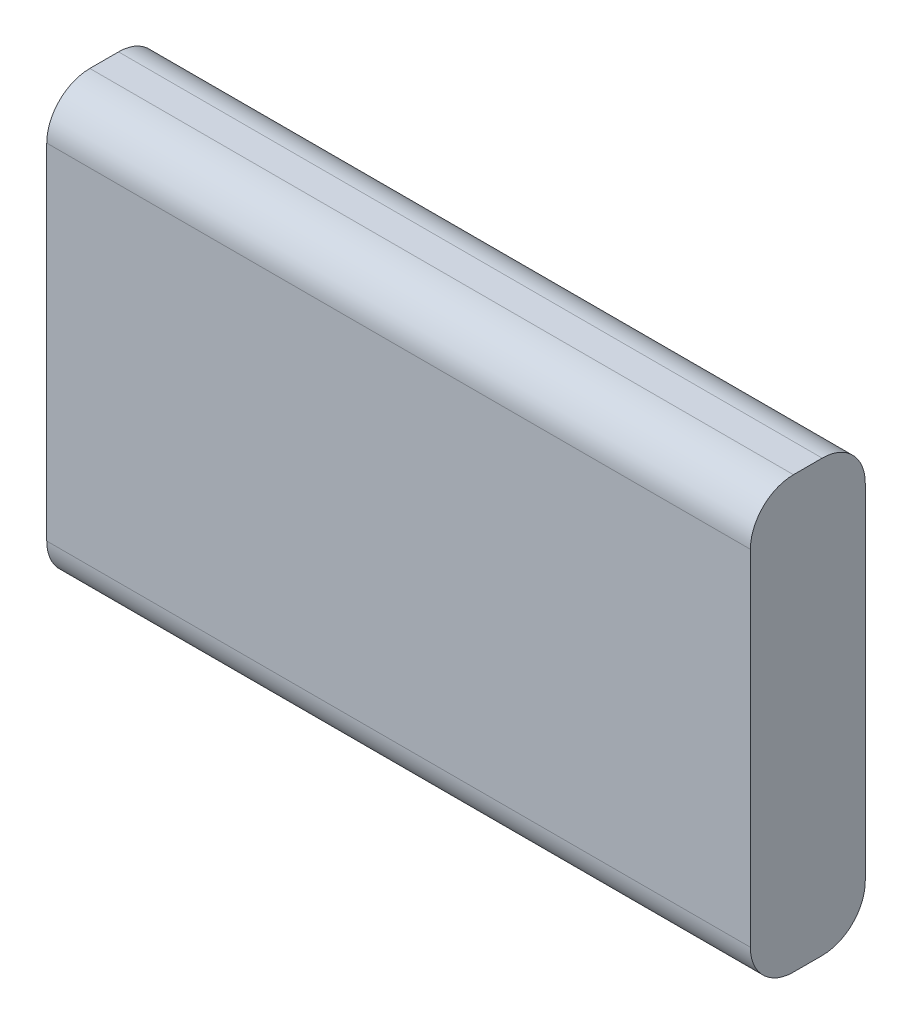
ISO-10303-21;
HEADER;
FILE_DESCRIPTION(('STEP AP214'),'2;1');
FILE_NAME('part.step','',(''),(''),'','','');
FILE_SCHEMA(('AUTOMOTIVE_DESIGN { 1 0 10303 214 1 1 1 1 }'));
ENDSEC;
DATA;
#1=APPLICATION_CONTEXT('core data for automotive mechanical design processes');
#2=APPLICATION_PROTOCOL_DEFINITION('international standard','automotive_design',2000,#1);
#3=PRODUCT_CONTEXT('',#1,'mechanical');
#4=PRODUCT('Part','Part','',(#3));
#5=PRODUCT_RELATED_PRODUCT_CATEGORY('part','',(#4));
#6=PRODUCT_DEFINITION_FORMATION('','',#4);
#7=PRODUCT_DEFINITION_CONTEXT('part definition',#1,'design');
#8=PRODUCT_DEFINITION('design','',#6,#7);
#9=PRODUCT_DEFINITION_SHAPE('','',#8);
#10=(LENGTH_UNIT() NAMED_UNIT(*) SI_UNIT(.MILLI.,.METRE.));
#11=(NAMED_UNIT(*) PLANE_ANGLE_UNIT() SI_UNIT($,.RADIAN.));
#12=(NAMED_UNIT(*) SI_UNIT($,.STERADIAN.) SOLID_ANGLE_UNIT());
#13=UNCERTAINTY_MEASURE_WITH_UNIT(LENGTH_MEASURE(1.E-05),#10,'distance_accuracy_value','');
#14=(GEOMETRIC_REPRESENTATION_CONTEXT(3) GLOBAL_UNCERTAINTY_ASSIGNED_CONTEXT((#13)) GLOBAL_UNIT_ASSIGNED_CONTEXT((#10,
#11,#12)) REPRESENTATION_CONTEXT('',''));
#15=CARTESIAN_POINT('',(0.,0.,0.));
#16=DIRECTION('',(0.,0.,1.));
#17=DIRECTION('',(1.,0.,0.));
#18=AXIS2_PLACEMENT_3D('',#15,#16,#17);
#19=CARTESIAN_POINT('',(0.,0.,8.));
#20=DIRECTION('',(1.,0.,0.));
#21=DIRECTION('',(0.,0.,-1.));
#22=AXIS2_PLACEMENT_3D('',#19,#20,#21);
#23=PLANE('',#22);
#24=DIRECTION('',(0.,-1.,0.));
#25=VECTOR('',#24,1.);
#26=CARTESIAN_POINT('',(0.,0.,0.));
#27=LINE('',#26,#25);
#28=CARTESIAN_POINT('',(0.,27.,0.));
#29=VERTEX_POINT('',#28);
#30=CARTESIAN_POINT('',(0.,3.,0.));
#31=VERTEX_POINT('',#30);
#32=EDGE_CURVE('E167',#29,#31,#27,.T.);
#33=ORIENTED_EDGE('',*,*,#32,.T.);
#34=CARTESIAN_POINT('',(0.,3.,3.));
#35=DIRECTION('',(1.,0.,0.));
#36=DIRECTION('',(0.,0.,-1.));
#37=AXIS2_PLACEMENT_3D('',#34,#35,#36);
#38=CIRCLE('',#37,3.);
#39=CARTESIAN_POINT('',(0.,0.,3.));
#40=VERTEX_POINT('',#39);
#41=EDGE_CURVE('E141',#31,#40,#38,.F.);
#42=ORIENTED_EDGE('',*,*,#41,.T.);
#43=DIRECTION('',(0.,0.,-1.));
#44=VECTOR('',#43,1.);
#45=CARTESIAN_POINT('',(0.,0.,8.));
#46=LINE('',#45,#44);
#47=CARTESIAN_POINT('',(0.,0.,5.));
#48=VERTEX_POINT('',#47);
#49=EDGE_CURVE('E120',#48,#40,#46,.T.);
#50=ORIENTED_EDGE('',*,*,#49,.F.);
#51=CARTESIAN_POINT('',(0.,3.,5.));
#52=DIRECTION('',(1.,0.,0.));
#53=DIRECTION('',(0.,0.,-1.));
#54=AXIS2_PLACEMENT_3D('',#51,#52,#53);
#55=CIRCLE('',#54,3.);
#56=CARTESIAN_POINT('',(0.,3.,8.));
#57=VERTEX_POINT('',#56);
#58=EDGE_CURVE('E125',#48,#57,#55,.F.);
#59=ORIENTED_EDGE('',*,*,#58,.T.);
#60=DIRECTION('',(0.,-1.,0.));
#61=VECTOR('',#60,1.);
#62=CARTESIAN_POINT('',(0.,0.,8.));
#63=LINE('',#62,#61);
#64=CARTESIAN_POINT('',(0.,27.,8.));
#65=VERTEX_POINT('',#64);
#66=EDGE_CURVE('E162',#65,#57,#63,.T.);
#67=ORIENTED_EDGE('',*,*,#66,.F.);
#68=CARTESIAN_POINT('',(0.,27.,5.));
#69=DIRECTION('',(1.,0.,0.));
#70=DIRECTION('',(0.,0.,-1.));
#71=AXIS2_PLACEMENT_3D('',#68,#69,#70);
#72=CIRCLE('',#71,3.);
#73=CARTESIAN_POINT('',(0.,30.,5.));
#74=VERTEX_POINT('',#73);
#75=EDGE_CURVE('E55',#65,#74,#72,.F.);
#76=ORIENTED_EDGE('',*,*,#75,.T.);
#77=DIRECTION('',(0.,0.,-1.));
#78=VECTOR('',#77,1.);
#79=CARTESIAN_POINT('',(0.,30.,8.));
#80=LINE('',#79,#78);
#81=CARTESIAN_POINT('',(0.,30.,3.));
#82=VERTEX_POINT('',#81);
#83=EDGE_CURVE('E152',#74,#82,#80,.T.);
#84=ORIENTED_EDGE('',*,*,#83,.T.);
#85=CARTESIAN_POINT('',(0.,27.,3.));
#86=DIRECTION('',(1.,0.,0.));
#87=DIRECTION('',(0.,0.,-1.));
#88=AXIS2_PLACEMENT_3D('',#85,#86,#87);
#89=CIRCLE('',#88,3.);
#90=EDGE_CURVE('E48',#82,#29,#89,.F.);
#91=ORIENTED_EDGE('',*,*,#90,.T.);
#92=EDGE_LOOP('',(#33,#42,#50,#59,#67,#76,#84,#91));
#93=FACE_BOUND('',#92,.T.);
#94=ADVANCED_FACE('F33',(#93),#23,.F.);
#95=CARTESIAN_POINT('',(0.,0.,8.));
#96=DIRECTION('',(0.,1.,0.));
#97=DIRECTION('',(0.,0.,1.));
#98=AXIS2_PLACEMENT_3D('',#95,#96,#97);
#99=PLANE('',#98);
#100=ORIENTED_EDGE('',*,*,#49,.T.);
#101=DIRECTION('',(1.,0.,0.));
#102=VECTOR('',#101,1.);
#103=CARTESIAN_POINT('',(49.,0.,3.));
#104=LINE('',#103,#102);
#105=CARTESIAN_POINT('',(49.,0.,3.));
#106=VERTEX_POINT('',#105);
#107=EDGE_CURVE('E119',#40,#106,#104,.T.);
#108=ORIENTED_EDGE('',*,*,#107,.T.);
#109=DIRECTION('',(0.,0.,-1.));
#110=VECTOR('',#109,1.);
#111=CARTESIAN_POINT('',(49.,0.,8.));
#112=LINE('',#111,#110);
#113=CARTESIAN_POINT('',(49.,0.,5.));
#114=VERTEX_POINT('',#113);
#115=EDGE_CURVE('E102',#114,#106,#112,.T.);
#116=ORIENTED_EDGE('',*,*,#115,.F.);
#117=DIRECTION('',(1.,0.,0.));
#118=VECTOR('',#117,1.);
#119=CARTESIAN_POINT('',(0.,0.,5.));
#120=LINE('',#119,#118);
#121=EDGE_CURVE('E116',#114,#48,#120,.F.);
#122=ORIENTED_EDGE('',*,*,#121,.T.);
#123=EDGE_LOOP('',(#100,#108,#116,#122));
#124=FACE_BOUND('',#123,.T.);
#125=ADVANCED_FACE('F115',(#124),#99,.F.);
#126=CARTESIAN_POINT('',(49.,0.,8.));
#127=DIRECTION('',(-1.,0.,0.));
#128=DIRECTION('',(0.,0.,1.));
#129=AXIS2_PLACEMENT_3D('',#126,#127,#128);
#130=PLANE('',#129);
#131=ORIENTED_EDGE('',*,*,#115,.T.);
#132=CARTESIAN_POINT('',(49.,3.,3.));
#133=DIRECTION('',(-1.,0.,0.));
#134=DIRECTION('',(0.,0.,1.));
#135=AXIS2_PLACEMENT_3D('',#132,#133,#134);
#136=CIRCLE('',#135,3.);
#137=CARTESIAN_POINT('',(49.,3.,0.));
#138=VERTEX_POINT('',#137);
#139=EDGE_CURVE('E109',#106,#138,#136,.F.);
#140=ORIENTED_EDGE('',*,*,#139,.T.);
#141=DIRECTION('',(0.,1.,0.));
#142=VECTOR('',#141,1.);
#143=CARTESIAN_POINT('',(49.,0.,0.));
#144=LINE('',#143,#142);
#145=CARTESIAN_POINT('',(49.,27.,0.));
#146=VERTEX_POINT('',#145);
#147=EDGE_CURVE('E164',#138,#146,#144,.T.);
#148=ORIENTED_EDGE('',*,*,#147,.T.);
#149=CARTESIAN_POINT('',(49.,27.,3.));
#150=DIRECTION('',(-1.,0.,0.));
#151=DIRECTION('',(0.,0.,1.));
#152=AXIS2_PLACEMENT_3D('',#149,#150,#151);
#153=CIRCLE('',#152,3.);
#154=CARTESIAN_POINT('',(49.,30.,3.));
#155=VERTEX_POINT('',#154);
#156=EDGE_CURVE('E110',#146,#155,#153,.F.);
#157=ORIENTED_EDGE('',*,*,#156,.T.);
#158=DIRECTION('',(0.,0.,-1.));
#159=VECTOR('',#158,1.);
#160=CARTESIAN_POINT('',(49.,30.,8.));
#161=LINE('',#160,#159);
#162=CARTESIAN_POINT('',(49.,30.,5.));
#163=VERTEX_POINT('',#162);
#164=EDGE_CURVE('E121',#163,#155,#161,.T.);
#165=ORIENTED_EDGE('',*,*,#164,.F.);
#166=CARTESIAN_POINT('',(49.,27.,5.));
#167=DIRECTION('',(-1.,0.,0.));
#168=DIRECTION('',(0.,0.,1.));
#169=AXIS2_PLACEMENT_3D('',#166,#167,#168);
#170=CIRCLE('',#169,3.);
#171=CARTESIAN_POINT('',(49.,27.,8.));
#172=VERTEX_POINT('',#171);
#173=EDGE_CURVE('E127',#163,#172,#170,.F.);
#174=ORIENTED_EDGE('',*,*,#173,.T.);
#175=DIRECTION('',(0.,1.,0.));
#176=VECTOR('',#175,1.);
#177=CARTESIAN_POINT('',(49.,0.,8.));
#178=LINE('',#177,#176);
#179=CARTESIAN_POINT('',(49.,3.,8.));
#180=VERTEX_POINT('',#179);
#181=EDGE_CURVE('E104',#180,#172,#178,.T.);
#182=ORIENTED_EDGE('',*,*,#181,.F.);
#183=CARTESIAN_POINT('',(49.,3.,5.));
#184=DIRECTION('',(-1.,0.,0.));
#185=DIRECTION('',(0.,0.,1.));
#186=AXIS2_PLACEMENT_3D('',#183,#184,#185);
#187=CIRCLE('',#186,3.);
#188=EDGE_CURVE('E99',#180,#114,#187,.F.);
#189=ORIENTED_EDGE('',*,*,#188,.T.);
#190=EDGE_LOOP('',(#131,#140,#148,#157,#165,#174,#182,#189));
#191=FACE_BOUND('',#190,.T.);
#192=ADVANCED_FACE('F101',(#191),#130,.F.);
#193=CARTESIAN_POINT('',(0.,30.,8.));
#194=DIRECTION('',(0.,-1.,0.));
#195=DIRECTION('',(0.,0.,-1.));
#196=AXIS2_PLACEMENT_3D('',#193,#194,#195);
#197=PLANE('',#196);
#198=ORIENTED_EDGE('',*,*,#164,.T.);
#199=DIRECTION('',(-1.,0.,0.));
#200=VECTOR('',#199,1.);
#201=CARTESIAN_POINT('',(0.,30.,3.));
#202=LINE('',#201,#200);
#203=EDGE_CURVE('E11',#155,#82,#202,.T.);
#204=ORIENTED_EDGE('',*,*,#203,.T.);
#205=ORIENTED_EDGE('',*,*,#83,.F.);
#206=DIRECTION('',(-1.,0.,0.));
#207=VECTOR('',#206,1.);
#208=CARTESIAN_POINT('',(0.,30.,5.));
#209=LINE('',#208,#207);
#210=EDGE_CURVE('E41',#74,#163,#209,.F.);
#211=ORIENTED_EDGE('',*,*,#210,.T.);
#212=EDGE_LOOP('',(#198,#204,#205,#211));
#213=FACE_BOUND('',#212,.T.);
#214=ADVANCED_FACE('F151',(#213),#197,.F.);
#215=CARTESIAN_POINT('',(0.,0.,8.));
#216=DIRECTION('',(0.,0.,-1.));
#217=DIRECTION('',(-1.,0.,0.));
#218=AXIS2_PLACEMENT_3D('',#215,#216,#217);
#219=PLANE('',#218);
#220=ORIENTED_EDGE('',*,*,#66,.T.);
#221=DIRECTION('',(1.,0.,0.));
#222=VECTOR('',#221,1.);
#223=CARTESIAN_POINT('',(0.,3.,8.));
#224=LINE('',#223,#222);
#225=EDGE_CURVE('E146',#57,#180,#224,.T.);
#226=ORIENTED_EDGE('',*,*,#225,.T.);
#227=ORIENTED_EDGE('',*,*,#181,.T.);
#228=DIRECTION('',(-1.,0.,0.));
#229=VECTOR('',#228,1.);
#230=CARTESIAN_POINT('',(0.,27.,8.));
#231=LINE('',#230,#229);
#232=EDGE_CURVE('E143',#172,#65,#231,.T.);
#233=ORIENTED_EDGE('',*,*,#232,.T.);
#234=EDGE_LOOP('',(#220,#226,#227,#233));
#235=FACE_BOUND('',#234,.T.);
#236=ADVANCED_FACE('F161',(#235),#219,.F.);
#237=CARTESIAN_POINT('',(0.,0.,0.));
#238=DIRECTION('',(0.,0.,-1.));
#239=DIRECTION('',(-1.,0.,0.));
#240=AXIS2_PLACEMENT_3D('',#237,#238,#239);
#241=PLANE('',#240);
#242=ORIENTED_EDGE('',*,*,#147,.F.);
#243=DIRECTION('',(1.,0.,0.));
#244=VECTOR('',#243,1.);
#245=CARTESIAN_POINT('',(0.,3.,0.));
#246=LINE('',#245,#244);
#247=EDGE_CURVE('E136',#138,#31,#246,.F.);
#248=ORIENTED_EDGE('',*,*,#247,.T.);
#249=ORIENTED_EDGE('',*,*,#32,.F.);
#250=DIRECTION('',(-1.,0.,0.));
#251=VECTOR('',#250,1.);
#252=CARTESIAN_POINT('',(49.,27.,0.));
#253=LINE('',#252,#251);
#254=EDGE_CURVE('E134',#29,#146,#253,.F.);
#255=ORIENTED_EDGE('',*,*,#254,.T.);
#256=EDGE_LOOP('',(#242,#248,#249,#255));
#257=FACE_BOUND('',#256,.T.);
#258=ADVANCED_FACE('F175',(#257),#241,.T.);
#259=CARTESIAN_POINT('',(0.,3.,3.));
#260=DIRECTION('',(-1.,0.,0.));
#261=DIRECTION('',(0.,0.,1.));
#262=AXIS2_PLACEMENT_3D('',#259,#260,#261);
#263=CYLINDRICAL_SURFACE('',#262,3.);
#264=ORIENTED_EDGE('',*,*,#41,.F.);
#265=ORIENTED_EDGE('',*,*,#247,.F.);
#266=ORIENTED_EDGE('',*,*,#139,.F.);
#267=ORIENTED_EDGE('',*,*,#107,.F.);
#268=EDGE_LOOP('',(#264,#265,#266,#267));
#269=FACE_BOUND('',#268,.T.);
#270=ADVANCED_FACE('F183',(#269),#263,.T.);
#271=CARTESIAN_POINT('',(0.,3.,5.));
#272=DIRECTION('',(1.,0.,0.));
#273=DIRECTION('',(0.,0.,-1.));
#274=AXIS2_PLACEMENT_3D('',#271,#272,#273);
#275=CYLINDRICAL_SURFACE('',#274,3.);
#276=ORIENTED_EDGE('',*,*,#58,.F.);
#277=ORIENTED_EDGE('',*,*,#121,.F.);
#278=ORIENTED_EDGE('',*,*,#188,.F.);
#279=ORIENTED_EDGE('',*,*,#225,.F.);
#280=EDGE_LOOP('',(#276,#277,#278,#279));
#281=FACE_BOUND('',#280,.T.);
#282=ADVANCED_FACE('F124',(#281),#275,.T.);
#283=CARTESIAN_POINT('',(0.,27.,3.));
#284=DIRECTION('',(1.,0.,0.));
#285=DIRECTION('',(0.,0.,-1.));
#286=AXIS2_PLACEMENT_3D('',#283,#284,#285);
#287=CYLINDRICAL_SURFACE('',#286,3.);
#288=ORIENTED_EDGE('',*,*,#156,.F.);
#289=ORIENTED_EDGE('',*,*,#254,.F.);
#290=ORIENTED_EDGE('',*,*,#90,.F.);
#291=ORIENTED_EDGE('',*,*,#203,.F.);
#292=EDGE_LOOP('',(#288,#289,#290,#291));
#293=FACE_BOUND('',#292,.T.);
#294=ADVANCED_FACE('F177',(#293),#287,.T.);
#295=CARTESIAN_POINT('',(0.,27.,5.));
#296=DIRECTION('',(-1.,0.,0.));
#297=DIRECTION('',(0.,0.,1.));
#298=AXIS2_PLACEMENT_3D('',#295,#296,#297);
#299=CYLINDRICAL_SURFACE('',#298,3.);
#300=ORIENTED_EDGE('',*,*,#173,.F.);
#301=ORIENTED_EDGE('',*,*,#210,.F.);
#302=ORIENTED_EDGE('',*,*,#75,.F.);
#303=ORIENTED_EDGE('',*,*,#232,.F.);
#304=EDGE_LOOP('',(#300,#301,#302,#303));
#305=FACE_BOUND('',#304,.T.);
#306=ADVANCED_FACE('F35',(#305),#299,.T.);
#307=CLOSED_SHELL('',(#94,#125,#192,#214,#236,#258,#270,#282,#294,#306));
#308=MANIFOLD_SOLID_BREP('B2',#307);
#309=ADVANCED_BREP_SHAPE_REPRESENTATION('',(#18,#308),#14);
#310=SHAPE_DEFINITION_REPRESENTATION(#9,#309);
ENDSEC;
END-ISO-10303-21;
